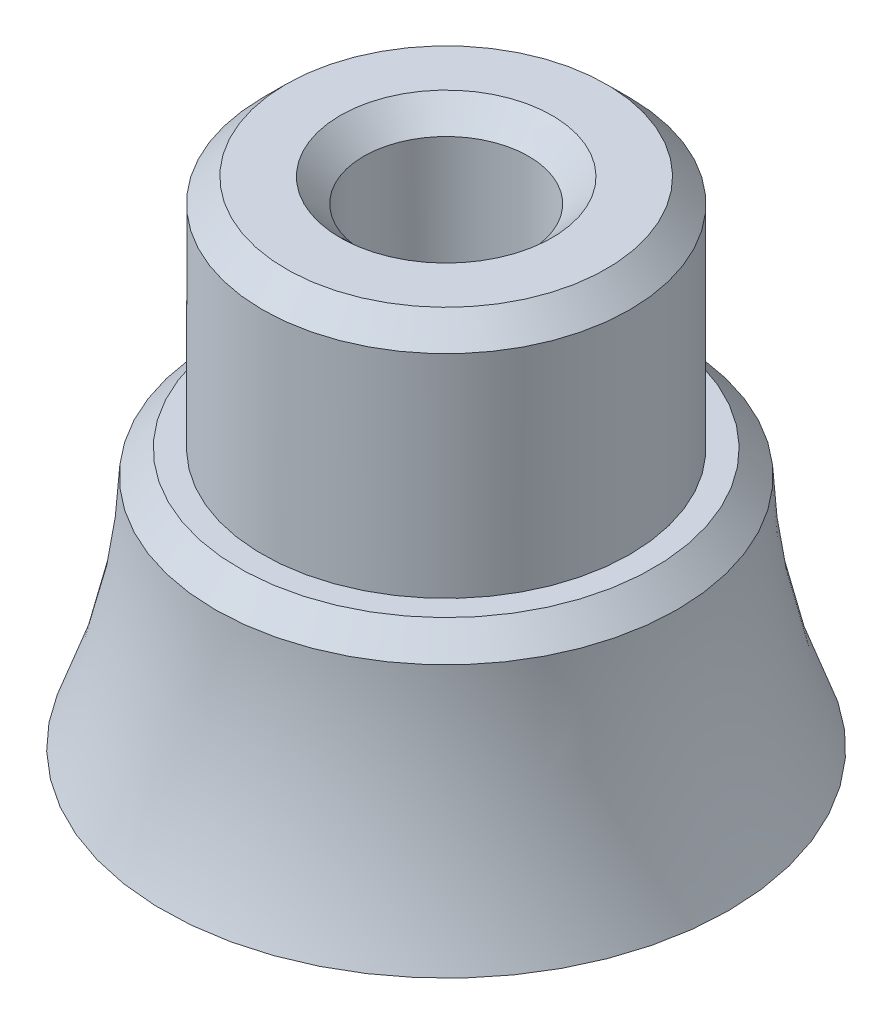
ISO-10303-21;
HEADER;
FILE_DESCRIPTION(('STEP AP214'),'2;1');
FILE_NAME('part.step','',(''),(''),'','','');
FILE_SCHEMA(('AUTOMOTIVE_DESIGN { 1 0 10303 214 1 1 1 1 }'));
ENDSEC;
DATA;
#1=APPLICATION_CONTEXT('core data for automotive mechanical design processes');
#2=APPLICATION_PROTOCOL_DEFINITION('international standard','automotive_design',2000,#1);
#3=PRODUCT_CONTEXT('',#1,'mechanical');
#4=PRODUCT('Part','Part','',(#3));
#5=PRODUCT_RELATED_PRODUCT_CATEGORY('part','',(#4));
#6=PRODUCT_DEFINITION_FORMATION('','',#4);
#7=PRODUCT_DEFINITION_CONTEXT('part definition',#1,'design');
#8=PRODUCT_DEFINITION('design','',#6,#7);
#9=PRODUCT_DEFINITION_SHAPE('','',#8);
#10=(LENGTH_UNIT() NAMED_UNIT(*) SI_UNIT(.MILLI.,.METRE.));
#11=(NAMED_UNIT(*) PLANE_ANGLE_UNIT() SI_UNIT($,.RADIAN.));
#12=(NAMED_UNIT(*) SI_UNIT($,.STERADIAN.) SOLID_ANGLE_UNIT());
#13=UNCERTAINTY_MEASURE_WITH_UNIT(LENGTH_MEASURE(1.E-05),#10,'distance_accuracy_value','');
#14=(GEOMETRIC_REPRESENTATION_CONTEXT(3) GLOBAL_UNCERTAINTY_ASSIGNED_CONTEXT((#13)) GLOBAL_UNIT_ASSIGNED_CONTEXT((#10,
#11,#12)) REPRESENTATION_CONTEXT('',''));
#15=CARTESIAN_POINT('',(0.,0.,0.));
#16=DIRECTION('',(0.,0.,1.));
#17=DIRECTION('',(1.,0.,0.));
#18=AXIS2_PLACEMENT_3D('',#15,#16,#17);
#19=CARTESIAN_POINT('',(6.,0.,0.));
#20=DIRECTION('',(0.,-1.,0.));
#21=DIRECTION('',(1.,0.,0.));
#22=AXIS2_PLACEMENT_3D('',#19,#20,#21);
#23=PLANE('',#22);
#24=CARTESIAN_POINT('',(0.,0.,0.));
#25=DIRECTION('',(0.,-1.,0.));
#26=DIRECTION('',(1.,0.,0.));
#27=AXIS2_PLACEMENT_3D('',#24,#25,#26);
#28=CIRCLE('',#27,2.25000000000002);
#29=CARTESIAN_POINT('',(2.25000000000002,0.,0.));
#30=VERTEX_POINT('',#29);
#31=EDGE_CURVE('E38',#30,#30,#28,.F.);
#32=ORIENTED_EDGE('',*,*,#31,.T.);
#33=EDGE_LOOP('',(#32));
#34=FACE_BOUND('',#33,.T.);
#35=CARTESIAN_POINT('',(0.,0.,0.));
#36=DIRECTION('',(0.,-1.,0.));
#37=DIRECTION('',(1.,0.,0.));
#38=AXIS2_PLACEMENT_3D('',#35,#36,#37);
#39=CIRCLE('',#38,6.);
#40=CARTESIAN_POINT('',(6.,0.,0.));
#41=VERTEX_POINT('',#40);
#42=EDGE_CURVE('E63',#41,#41,#39,.T.);
#43=ORIENTED_EDGE('',*,*,#42,.T.);
#44=EDGE_LOOP('',(#43));
#45=FACE_BOUND('',#44,.T.);
#46=ADVANCED_FACE('F31',(#34,#45),#23,.T.);
#47=CARTESIAN_POINT('',(0.,5.5,0.));
#48=DIRECTION('',(0.,-1.,0.));
#49=DIRECTION('',(1.,0.,0.));
#50=AXIS2_PLACEMENT_3D('',#47,#48,#49);
#51=TOROIDAL_SURFACE('',#50,19.2,14.3);
#52=CARTESIAN_POINT('',(0.,4.99093607574477,0.));
#53=DIRECTION('',(0.,1.,0.));
#54=DIRECTION('',(-1.,0.,0.));
#55=AXIS2_PLACEMENT_3D('',#52,#53,#54);
#56=CIRCLE('',#55,4.9090639242553);
#57=CARTESIAN_POINT('',(-4.90906392425532,4.99093607574475,0.));
#58=VERTEX_POINT('',#57);
#59=EDGE_CURVE('E60',#58,#58,#56,.F.);
#60=ORIENTED_EDGE('',*,*,#59,.T.);
#61=EDGE_LOOP('',(#60));
#62=FACE_BOUND('',#61,.T.);
#63=ORIENTED_EDGE('',*,*,#42,.F.);
#64=EDGE_LOOP('',(#63));
#65=FACE_BOUND('',#64,.T.);
#66=ADVANCED_FACE('F83',(#62,#65),#51,.F.);
#67=CARTESIAN_POINT('',(3.9,5.5,0.));
#68=DIRECTION('',(0.,1.,0.));
#69=DIRECTION('',(-1.,0.,0.));
#70=AXIS2_PLACEMENT_3D('',#67,#68,#69);
#71=PLANE('',#70);
#72=CARTESIAN_POINT('',(0.,5.49999999999998,0.));
#73=DIRECTION('',(0.,1.,0.));
#74=DIRECTION('',(-1.,0.,0.));
#75=AXIS2_PLACEMENT_3D('',#72,#73,#74);
#76=CIRCLE('',#75,4.40000000000009);
#77=CARTESIAN_POINT('',(-4.40000000000011,5.49999999999997,0.));
#78=VERTEX_POINT('',#77);
#79=EDGE_CURVE('E57',#78,#78,#76,.T.);
#80=ORIENTED_EDGE('',*,*,#79,.T.);
#81=EDGE_LOOP('',(#80));
#82=FACE_BOUND('',#81,.T.);
#83=CARTESIAN_POINT('',(0.,5.50000000000006,0.));
#84=DIRECTION('',(0.,-1.,0.));
#85=DIRECTION('',(1.,0.,0.));
#86=AXIS2_PLACEMENT_3D('',#83,#84,#85);
#87=CIRCLE('',#86,3.90000000000002);
#88=CARTESIAN_POINT('',(3.9,5.50000000000007,0.));
#89=VERTEX_POINT('',#88);
#90=EDGE_CURVE('E66',#89,#89,#87,.T.);
#91=ORIENTED_EDGE('',*,*,#90,.T.);
#92=EDGE_LOOP('',(#91));
#93=FACE_BOUND('',#92,.T.);
#94=ADVANCED_FACE('F70',(#82,#93),#71,.T.);
#95=CARTESIAN_POINT('',(3.67522687981103E-12,-1052.62681456255,0.));
#96=DIRECTION('',(0.,-1.,0.));
#97=DIRECTION('',(1.,0.,0.));
#98=AXIS2_PLACEMENT_3D('',#95,#96,#97);
#99=CYLINDRICAL_SURFACE('',#98,3.90000000000003);
#100=CARTESIAN_POINT('',(0.,10.,0.));
#101=DIRECTION('',(0.,1.,0.));
#102=DIRECTION('',(-1.,0.,0.));
#103=AXIS2_PLACEMENT_3D('',#100,#101,#102);
#104=CIRCLE('',#103,3.90000000000003);
#105=CARTESIAN_POINT('',(-3.90000000000006,9.99999999999999,0.));
#106=VERTEX_POINT('',#105);
#107=EDGE_CURVE('E10',#106,#106,#104,.F.);
#108=ORIENTED_EDGE('',*,*,#107,.T.);
#109=EDGE_LOOP('',(#108));
#110=FACE_BOUND('',#109,.T.);
#111=ORIENTED_EDGE('',*,*,#90,.F.);
#112=EDGE_LOOP('',(#111));
#113=FACE_BOUND('',#112,.T.);
#114=ADVANCED_FACE('F72',(#110,#113),#99,.T.);
#115=CARTESIAN_POINT('',(1.75,10.5,0.));
#116=DIRECTION('',(0.,1.,0.));
#117=DIRECTION('',(-1.,0.,0.));
#118=AXIS2_PLACEMENT_3D('',#115,#116,#117);
#119=PLANE('',#118);
#120=CARTESIAN_POINT('',(0.,10.5,0.));
#121=DIRECTION('',(0.,1.,0.));
#122=DIRECTION('',(-1.,0.,0.));
#123=AXIS2_PLACEMENT_3D('',#120,#121,#122);
#124=CIRCLE('',#123,2.25000000000019);
#125=CARTESIAN_POINT('',(-2.25000000000022,10.5,0.));
#126=VERTEX_POINT('',#125);
#127=EDGE_CURVE('E51',#126,#126,#124,.F.);
#128=ORIENTED_EDGE('',*,*,#127,.T.);
#129=EDGE_LOOP('',(#128));
#130=FACE_BOUND('',#129,.T.);
#131=CARTESIAN_POINT('',(0.,10.5,0.));
#132=DIRECTION('',(0.,1.,0.));
#133=DIRECTION('',(-1.,0.,0.));
#134=AXIS2_PLACEMENT_3D('',#131,#132,#133);
#135=CIRCLE('',#134,3.39999999999998);
#136=CARTESIAN_POINT('',(-3.40000000000002,10.5,0.));
#137=VERTEX_POINT('',#136);
#138=EDGE_CURVE('E54',#137,#137,#135,.T.);
#139=ORIENTED_EDGE('',*,*,#138,.T.);
#140=EDGE_LOOP('',(#139));
#141=FACE_BOUND('',#140,.T.);
#142=ADVANCED_FACE('F74',(#130,#141),#119,.T.);
#143=CARTESIAN_POINT('',(3.67522687981103E-12,-1052.62681456255,0.));
#144=DIRECTION('',(0.,-1.,0.));
#145=DIRECTION('',(1.,0.,0.));
#146=AXIS2_PLACEMENT_3D('',#143,#144,#145);
#147=CYLINDRICAL_SURFACE('',#146,1.75000000000002);
#148=CARTESIAN_POINT('',(0.,9.99999999999979,0.));
#149=DIRECTION('',(0.,1.,0.));
#150=DIRECTION('',(-1.,0.,0.));
#151=AXIS2_PLACEMENT_3D('',#148,#149,#150);
#152=CIRCLE('',#151,1.75000000000002);
#153=CARTESIAN_POINT('',(-1.75000000000005,9.99999999999978,0.));
#154=VERTEX_POINT('',#153);
#155=EDGE_CURVE('E42',#154,#154,#152,.T.);
#156=ORIENTED_EDGE('',*,*,#155,.T.);
#157=EDGE_LOOP('',(#156));
#158=FACE_BOUND('',#157,.T.);
#159=CARTESIAN_POINT('',(0.,0.499999999999945,0.));
#160=DIRECTION('',(0.,-1.,0.));
#161=DIRECTION('',(1.,0.,0.));
#162=AXIS2_PLACEMENT_3D('',#159,#160,#161);
#163=CIRCLE('',#162,1.75000000000002);
#164=CARTESIAN_POINT('',(1.75000000000002,0.499999999999951,0.));
#165=VERTEX_POINT('',#164);
#166=EDGE_CURVE('E46',#165,#165,#163,.T.);
#167=ORIENTED_EDGE('',*,*,#166,.T.);
#168=EDGE_LOOP('',(#167));
#169=FACE_BOUND('',#168,.T.);
#170=ADVANCED_FACE('F80',(#158,#169),#147,.F.);
#171=CARTESIAN_POINT('',(0.,4.99093607574477,0.));
#172=DIRECTION('',(0.,-1.,0.));
#173=DIRECTION('',(1.,0.,0.));
#174=AXIS2_PLACEMENT_3D('',#171,#172,#173);
#175=CONICAL_SURFACE('',#174,4.9090639242553,0.78539816339745);
#176=ORIENTED_EDGE('',*,*,#79,.F.);
#177=EDGE_LOOP('',(#176));
#178=FACE_BOUND('',#177,.T.);
#179=ORIENTED_EDGE('',*,*,#59,.F.);
#180=EDGE_LOOP('',(#179));
#181=FACE_BOUND('',#180,.T.);
#182=ADVANCED_FACE('F95',(#178,#181),#175,.T.);
#183=CARTESIAN_POINT('',(0.,10.5,0.));
#184=DIRECTION('',(0.,1.,0.));
#185=DIRECTION('',(-1.,0.,0.));
#186=AXIS2_PLACEMENT_3D('',#183,#184,#185);
#187=CONICAL_SURFACE('',#186,2.25000000000015,0.785398163397412);
#188=ORIENTED_EDGE('',*,*,#155,.F.);
#189=EDGE_LOOP('',(#188));
#190=FACE_BOUND('',#189,.T.);
#191=ORIENTED_EDGE('',*,*,#127,.F.);
#192=EDGE_LOOP('',(#191));
#193=FACE_BOUND('',#192,.T.);
#194=ADVANCED_FACE('F98',(#190,#193),#187,.F.);
#195=CARTESIAN_POINT('',(0.,0.499999999999945,0.));
#196=DIRECTION('',(0.,-1.,0.));
#197=DIRECTION('',(1.,0.,0.));
#198=AXIS2_PLACEMENT_3D('',#195,#196,#197);
#199=CONICAL_SURFACE('',#198,1.75000000000002,0.78539816339749);
#200=ORIENTED_EDGE('',*,*,#31,.F.);
#201=EDGE_LOOP('',(#200));
#202=FACE_BOUND('',#201,.T.);
#203=ORIENTED_EDGE('',*,*,#166,.F.);
#204=EDGE_LOOP('',(#203));
#205=FACE_BOUND('',#204,.T.);
#206=ADVANCED_FACE('F101',(#202,#205),#199,.F.);
#207=CARTESIAN_POINT('',(0.,10.,0.));
#208=DIRECTION('',(0.,-1.,0.));
#209=DIRECTION('',(1.,0.,0.));
#210=AXIS2_PLACEMENT_3D('',#207,#208,#209);
#211=CONICAL_SURFACE('',#210,3.90000000000003,0.78539816339751);
#212=ORIENTED_EDGE('',*,*,#138,.F.);
#213=EDGE_LOOP('',(#212));
#214=FACE_BOUND('',#213,.T.);
#215=ORIENTED_EDGE('',*,*,#107,.F.);
#216=EDGE_LOOP('',(#215));
#217=FACE_BOUND('',#216,.T.);
#218=ADVANCED_FACE('F33',(#214,#217),#211,.T.);
#219=CLOSED_SHELL('',(#46,#66,#94,#114,#142,#170,#182,#194,#206,#218));
#220=MANIFOLD_SOLID_BREP('B2',#219);
#221=ADVANCED_BREP_SHAPE_REPRESENTATION('',(#18,#220),#14);
#222=SHAPE_DEFINITION_REPRESENTATION(#9,#221);
ENDSEC;
END-ISO-10303-21;
